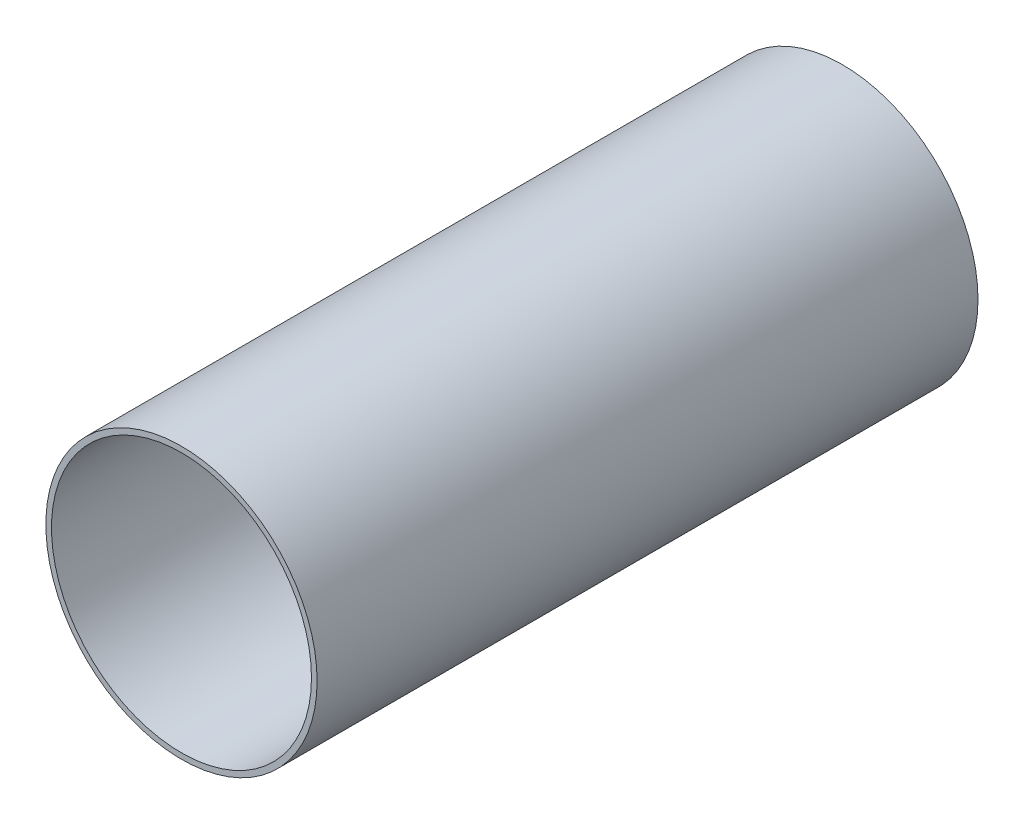
ISO-10303-21;
HEADER;
FILE_DESCRIPTION(('STEP AP214'),'2;1');
FILE_NAME('part.step','',(''),(''),'','','');
FILE_SCHEMA(('AUTOMOTIVE_DESIGN { 1 0 10303 214 1 1 1 1 }'));
ENDSEC;
DATA;
#1=APPLICATION_CONTEXT('core data for automotive mechanical design processes');
#2=APPLICATION_PROTOCOL_DEFINITION('international standard','automotive_design',2000,#1);
#3=PRODUCT_CONTEXT('',#1,'mechanical');
#4=PRODUCT('Part','Part','',(#3));
#5=PRODUCT_RELATED_PRODUCT_CATEGORY('part','',(#4));
#6=PRODUCT_DEFINITION_FORMATION('','',#4);
#7=PRODUCT_DEFINITION_CONTEXT('part definition',#1,'design');
#8=PRODUCT_DEFINITION('design','',#6,#7);
#9=PRODUCT_DEFINITION_SHAPE('','',#8);
#10=(LENGTH_UNIT() NAMED_UNIT(*) SI_UNIT(.MILLI.,.METRE.));
#11=(NAMED_UNIT(*) PLANE_ANGLE_UNIT() SI_UNIT($,.RADIAN.));
#12=(NAMED_UNIT(*) SI_UNIT($,.STERADIAN.) SOLID_ANGLE_UNIT());
#13=UNCERTAINTY_MEASURE_WITH_UNIT(LENGTH_MEASURE(1.E-05),#10,'distance_accuracy_value','');
#14=(GEOMETRIC_REPRESENTATION_CONTEXT(3) GLOBAL_UNCERTAINTY_ASSIGNED_CONTEXT((#13)) GLOBAL_UNIT_ASSIGNED_CONTEXT((#10,
#11,#12)) REPRESENTATION_CONTEXT('',''));
#15=CARTESIAN_POINT('',(0.,0.,0.));
#16=DIRECTION('',(0.,0.,1.));
#17=DIRECTION('',(1.,0.,0.));
#18=AXIS2_PLACEMENT_3D('',#15,#16,#17);
#19=CARTESIAN_POINT('',(0.,0.,123.7742));
#20=DIRECTION('',(0.,0.,1.));
#21=DIRECTION('',(1.,0.,0.));
#22=AXIS2_PLACEMENT_3D('',#19,#20,#21);
#23=CYLINDRICAL_SURFACE('',#22,48.6918);
#24=CARTESIAN_POINT('',(0.,0.,-123.7742));
#25=DIRECTION('',(0.,0.,1.));
#26=DIRECTION('',(1.,0.,0.));
#27=AXIS2_PLACEMENT_3D('',#24,#25,#26);
#28=CIRCLE('',#27,48.6918);
#29=CARTESIAN_POINT('',(48.6918,0.,-123.7742));
#30=VERTEX_POINT('',#29);
#31=EDGE_CURVE('E26',#30,#30,#28,.T.);
#32=ORIENTED_EDGE('',*,*,#31,.F.);
#33=EDGE_LOOP('',(#32));
#34=FACE_BOUND('',#33,.T.);
#35=CARTESIAN_POINT('',(0.,0.,123.7742));
#36=DIRECTION('',(0.,0.,1.));
#37=DIRECTION('',(1.,0.,0.));
#38=AXIS2_PLACEMENT_3D('',#35,#36,#37);
#39=CIRCLE('',#38,48.6918);
#40=CARTESIAN_POINT('',(48.6918,0.,123.7742));
#41=VERTEX_POINT('',#40);
#42=EDGE_CURVE('E17',#41,#41,#39,.T.);
#43=ORIENTED_EDGE('',*,*,#42,.T.);
#44=EDGE_LOOP('',(#43));
#45=FACE_BOUND('',#44,.T.);
#46=ADVANCED_FACE('F14',(#34,#45),#23,.F.);
#47=CARTESIAN_POINT('',(0.,0.,123.7742));
#48=DIRECTION('',(0.,0.,-1.));
#49=DIRECTION('',(-1.,0.,0.));
#50=AXIS2_PLACEMENT_3D('',#47,#48,#49);
#51=PLANE('',#50);
#52=CARTESIAN_POINT('',(0.,0.,123.7742));
#53=DIRECTION('',(0.,0.,1.));
#54=DIRECTION('',(1.,0.,0.));
#55=AXIS2_PLACEMENT_3D('',#52,#53,#54);
#56=CIRCLE('',#55,50.8);
#57=CARTESIAN_POINT('',(50.8,0.,123.7742));
#58=VERTEX_POINT('',#57);
#59=EDGE_CURVE('E21',#58,#58,#56,.F.);
#60=ORIENTED_EDGE('',*,*,#59,.F.);
#61=EDGE_LOOP('',(#60));
#62=FACE_BOUND('',#61,.T.);
#63=ORIENTED_EDGE('',*,*,#42,.F.);
#64=EDGE_LOOP('',(#63));
#65=FACE_BOUND('',#64,.T.);
#66=ADVANCED_FACE('F35',(#62,#65),#51,.F.);
#67=CARTESIAN_POINT('',(0.,0.,-123.7742));
#68=DIRECTION('',(0.,0.,-1.));
#69=DIRECTION('',(-1.,0.,0.));
#70=AXIS2_PLACEMENT_3D('',#67,#68,#69);
#71=PLANE('',#70);
#72=CARTESIAN_POINT('',(0.,0.,-123.7742));
#73=DIRECTION('',(0.,0.,1.));
#74=DIRECTION('',(1.,0.,0.));
#75=AXIS2_PLACEMENT_3D('',#72,#73,#74);
#76=CIRCLE('',#75,50.8);
#77=CARTESIAN_POINT('',(50.8,0.,-123.7742));
#78=VERTEX_POINT('',#77);
#79=EDGE_CURVE('E10',#78,#78,#76,.T.);
#80=ORIENTED_EDGE('',*,*,#79,.F.);
#81=EDGE_LOOP('',(#80));
#82=FACE_BOUND('',#81,.T.);
#83=ORIENTED_EDGE('',*,*,#31,.T.);
#84=EDGE_LOOP('',(#83));
#85=FACE_BOUND('',#84,.T.);
#86=ADVANCED_FACE('F37',(#82,#85),#71,.T.);
#87=CARTESIAN_POINT('',(0.,0.,123.7742));
#88=DIRECTION('',(0.,0.,1.));
#89=DIRECTION('',(1.,0.,0.));
#90=AXIS2_PLACEMENT_3D('',#87,#88,#89);
#91=CYLINDRICAL_SURFACE('',#90,50.8);
#92=ORIENTED_EDGE('',*,*,#79,.T.);
#93=EDGE_LOOP('',(#92));
#94=FACE_BOUND('',#93,.T.);
#95=ORIENTED_EDGE('',*,*,#59,.T.);
#96=EDGE_LOOP('',(#95));
#97=FACE_BOUND('',#96,.T.);
#98=ADVANCED_FACE('F44',(#94,#97),#91,.T.);
#99=CLOSED_SHELL('',(#46,#66,#86,#98));
#100=MANIFOLD_SOLID_BREP('B1',#99);
#101=ADVANCED_BREP_SHAPE_REPRESENTATION('',(#18,#100),#14);
#102=SHAPE_DEFINITION_REPRESENTATION(#9,#101);
ENDSEC;
END-ISO-10303-21;
